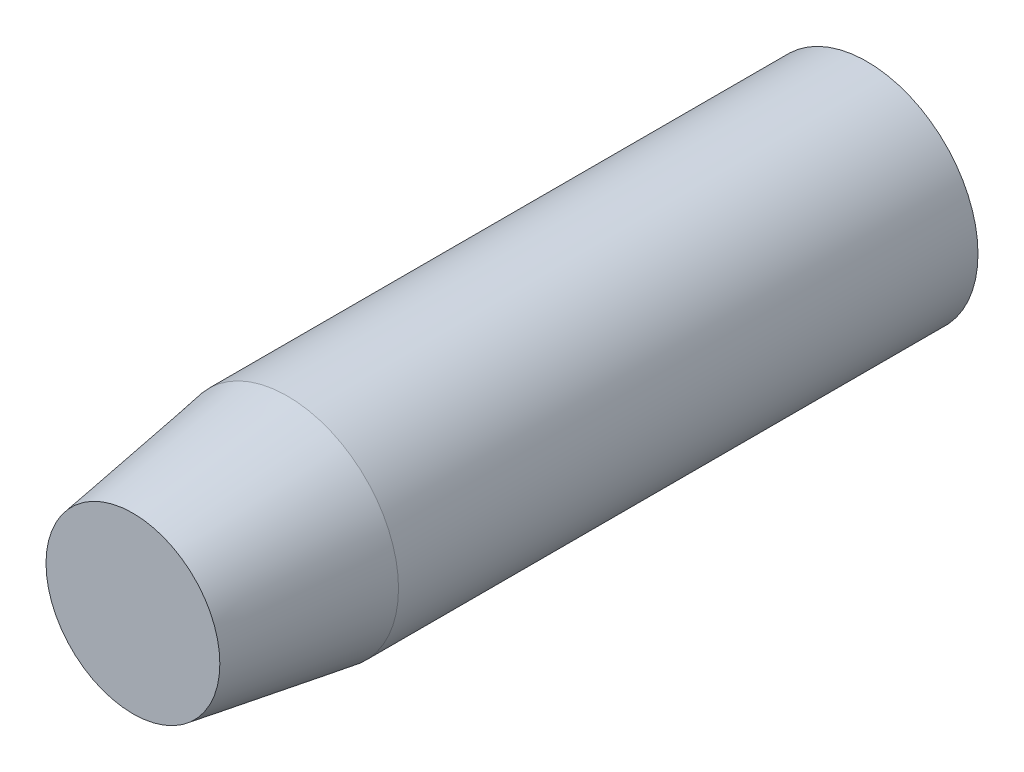
ISO-10303-21;
HEADER;
FILE_DESCRIPTION(('STEP AP214'),'2;1');
FILE_NAME('part.step','',(''),(''),'','','');
FILE_SCHEMA(('AUTOMOTIVE_DESIGN { 1 0 10303 214 1 1 1 1 }'));
ENDSEC;
DATA;
#1=APPLICATION_CONTEXT('core data for automotive mechanical design processes');
#2=APPLICATION_PROTOCOL_DEFINITION('international standard','automotive_design',2000,#1);
#3=PRODUCT_CONTEXT('',#1,'mechanical');
#4=PRODUCT('Part','Part','',(#3));
#5=PRODUCT_RELATED_PRODUCT_CATEGORY('part','',(#4));
#6=PRODUCT_DEFINITION_FORMATION('','',#4);
#7=PRODUCT_DEFINITION_CONTEXT('part definition',#1,'design');
#8=PRODUCT_DEFINITION('design','',#6,#7);
#9=PRODUCT_DEFINITION_SHAPE('','',#8);
#10=(LENGTH_UNIT() NAMED_UNIT(*) SI_UNIT(.MILLI.,.METRE.));
#11=(NAMED_UNIT(*) PLANE_ANGLE_UNIT() SI_UNIT($,.RADIAN.));
#12=(NAMED_UNIT(*) SI_UNIT($,.STERADIAN.) SOLID_ANGLE_UNIT());
#13=UNCERTAINTY_MEASURE_WITH_UNIT(LENGTH_MEASURE(1.E-05),#10,'distance_accuracy_value','');
#14=(GEOMETRIC_REPRESENTATION_CONTEXT(3) GLOBAL_UNCERTAINTY_ASSIGNED_CONTEXT((#13)) GLOBAL_UNIT_ASSIGNED_CONTEXT((#10,
#11,#12)) REPRESENTATION_CONTEXT('',''));
#15=CARTESIAN_POINT('',(0.,0.,0.));
#16=DIRECTION('',(0.,0.,1.));
#17=DIRECTION('',(1.,0.,0.));
#18=AXIS2_PLACEMENT_3D('',#15,#16,#17);
#19=CARTESIAN_POINT('',(0.,0.,60.325));
#20=DIRECTION('',(0.,0.,-1.));
#21=DIRECTION('',(-1.,0.,0.));
#22=AXIS2_PLACEMENT_3D('',#19,#20,#21);
#23=CYLINDRICAL_SURFACE('',#22,18.25625);
#24=CARTESIAN_POINT('',(0.,0.,34.9250000000015));
#25=DIRECTION('',(0.,0.,1.));
#26=DIRECTION('',(1.,0.,0.));
#27=AXIS2_PLACEMENT_3D('',#24,#25,#26);
#28=CIRCLE('',#27,18.25625);
#29=CARTESIAN_POINT('',(18.25625,0.,34.9250000000015));
#30=VERTEX_POINT('',#29);
#31=EDGE_CURVE('E10',#30,#30,#28,.F.);
#32=ORIENTED_EDGE('',*,*,#31,.T.);
#33=EDGE_LOOP('',(#32));
#34=FACE_BOUND('',#33,.T.);
#35=CARTESIAN_POINT('',(0.,0.,-60.325));
#36=DIRECTION('',(0.,0.,1.));
#37=DIRECTION('',(1.,0.,0.));
#38=AXIS2_PLACEMENT_3D('',#35,#36,#37);
#39=CIRCLE('',#38,18.25625);
#40=CARTESIAN_POINT('',(18.25625,0.,-60.325));
#41=VERTEX_POINT('',#40);
#42=EDGE_CURVE('E43',#41,#41,#39,.T.);
#43=ORIENTED_EDGE('',*,*,#42,.T.);
#44=EDGE_LOOP('',(#43));
#45=FACE_BOUND('',#44,.T.);
#46=ADVANCED_FACE('F32',(#34,#45),#23,.T.);
#47=CARTESIAN_POINT('',(0.,0.,60.325));
#48=DIRECTION('',(0.,0.,1.));
#49=DIRECTION('',(1.,0.,0.));
#50=AXIS2_PLACEMENT_3D('',#47,#48,#49);
#51=PLANE('',#50);
#52=CARTESIAN_POINT('',(0.,0.,60.325));
#53=DIRECTION('',(0.,0.,1.));
#54=DIRECTION('',(1.,0.,0.));
#55=AXIS2_PLACEMENT_3D('',#52,#53,#54);
#56=CIRCLE('',#55,14.2875000000003);
#57=CARTESIAN_POINT('',(14.2875000000003,0.,60.325));
#58=VERTEX_POINT('',#57);
#59=EDGE_CURVE('E39',#58,#58,#56,.T.);
#60=ORIENTED_EDGE('',*,*,#59,.T.);
#61=EDGE_LOOP('',(#60));
#62=FACE_BOUND('',#61,.T.);
#63=ADVANCED_FACE('F53',(#62),#51,.T.);
#64=CARTESIAN_POINT('',(0.,0.,-60.325));
#65=DIRECTION('',(0.,0.,1.));
#66=DIRECTION('',(1.,0.,0.));
#67=AXIS2_PLACEMENT_3D('',#64,#65,#66);
#68=PLANE('',#67);
#69=ORIENTED_EDGE('',*,*,#42,.F.);
#70=EDGE_LOOP('',(#69));
#71=FACE_BOUND('',#70,.T.);
#72=ADVANCED_FACE('F51',(#71),#68,.F.);
#73=CARTESIAN_POINT('',(0.,0.,60.325));
#74=DIRECTION('',(0.,0.,-1.));
#75=DIRECTION('',(-1.,0.,0.));
#76=AXIS2_PLACEMENT_3D('',#73,#74,#75);
#77=CONICAL_SURFACE('',#76,14.2875000000003,0.154996741923938);
#78=ORIENTED_EDGE('',*,*,#31,.F.);
#79=EDGE_LOOP('',(#78));
#80=FACE_BOUND('',#79,.T.);
#81=ORIENTED_EDGE('',*,*,#59,.F.);
#82=EDGE_LOOP('',(#81));
#83=FACE_BOUND('',#82,.T.);
#84=ADVANCED_FACE('F34',(#80,#83),#77,.T.);
#85=CLOSED_SHELL('',(#46,#63,#72,#84));
#86=MANIFOLD_SOLID_BREP('B2',#85);
#87=ADVANCED_BREP_SHAPE_REPRESENTATION('',(#18,#86),#14);
#88=SHAPE_DEFINITION_REPRESENTATION(#9,#87);
ENDSEC;
END-ISO-10303-21;
